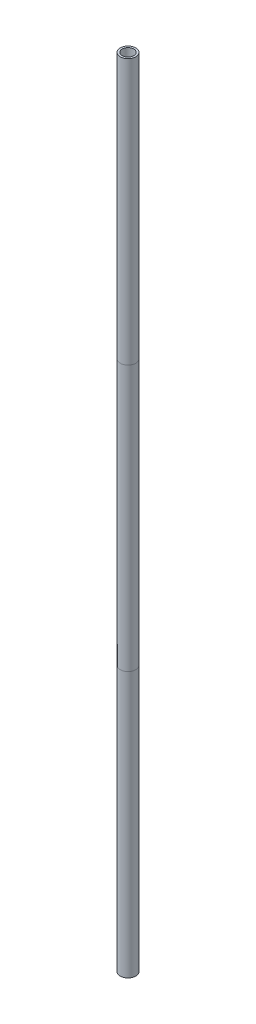
ISO-10303-21;
HEADER;
FILE_DESCRIPTION(('STEP AP214'),'2;1');
FILE_NAME('part.step','',(''),(''),'','','');
FILE_SCHEMA(('AUTOMOTIVE_DESIGN { 1 0 10303 214 1 1 1 1 }'));
ENDSEC;
DATA;
#1=APPLICATION_CONTEXT('core data for automotive mechanical design processes');
#2=APPLICATION_PROTOCOL_DEFINITION('international standard','automotive_design',2000,#1);
#3=PRODUCT_CONTEXT('',#1,'mechanical');
#4=PRODUCT('Part','Part','',(#3));
#5=PRODUCT_RELATED_PRODUCT_CATEGORY('part','',(#4));
#6=PRODUCT_DEFINITION_FORMATION('','',#4);
#7=PRODUCT_DEFINITION_CONTEXT('part definition',#1,'design');
#8=PRODUCT_DEFINITION('design','',#6,#7);
#9=PRODUCT_DEFINITION_SHAPE('','',#8);
#10=(LENGTH_UNIT() NAMED_UNIT(*) SI_UNIT(.MILLI.,.METRE.));
#11=(NAMED_UNIT(*) PLANE_ANGLE_UNIT() SI_UNIT($,.RADIAN.));
#12=(NAMED_UNIT(*) SI_UNIT($,.STERADIAN.) SOLID_ANGLE_UNIT());
#13=UNCERTAINTY_MEASURE_WITH_UNIT(LENGTH_MEASURE(1.E-05),#10,'distance_accuracy_value','');
#14=(GEOMETRIC_REPRESENTATION_CONTEXT(3) GLOBAL_UNCERTAINTY_ASSIGNED_CONTEXT((#13)) GLOBAL_UNIT_ASSIGNED_CONTEXT((#10,
#11,#12)) REPRESENTATION_CONTEXT('',''));
#15=CARTESIAN_POINT('',(0.,0.,0.));
#16=DIRECTION('',(0.,0.,1.));
#17=DIRECTION('',(1.,0.,0.));
#18=AXIS2_PLACEMENT_3D('',#15,#16,#17);
#19=CARTESIAN_POINT('',(-19.5,1333.33333333333,-19.51));
#20=DIRECTION('',(0.,-1.,0.));
#21=DIRECTION('',(0.,0.,-1.));
#22=AXIS2_PLACEMENT_3D('',#19,#20,#21);
#23=PLANE('',#22);
#24=CARTESIAN_POINT('',(0.,1333.33333333333,0.));
#25=DIRECTION('',(0.,-1.,0.));
#26=DIRECTION('',(0.,0.,-1.));
#27=AXIS2_PLACEMENT_3D('',#24,#25,#26);
#28=CIRCLE('',#27,19.5);
#29=CARTESIAN_POINT('',(0.,1333.33333333333,-19.5));
#30=VERTEX_POINT('',#29);
#31=EDGE_CURVE('E68',#30,#30,#28,.T.);
#32=ORIENTED_EDGE('',*,*,#31,.T.);
#33=EDGE_LOOP('',(#32));
#34=FACE_BOUND('',#33,.T.);
#35=CARTESIAN_POINT('',(0.,1333.33333333333,0.));
#36=DIRECTION('',(0.,-1.,0.));
#37=DIRECTION('',(0.,0.,-1.));
#38=AXIS2_PLACEMENT_3D('',#35,#36,#37);
#39=CIRCLE('',#38,14.5);
#40=CARTESIAN_POINT('',(0.,1333.33333333333,-14.5));
#41=VERTEX_POINT('',#40);
#42=EDGE_CURVE('E58',#41,#41,#39,.T.);
#43=ORIENTED_EDGE('',*,*,#42,.F.);
#44=EDGE_LOOP('',(#43));
#45=FACE_BOUND('',#44,.T.);
#46=ADVANCED_FACE('F54',(#34,#45),#23,.T.);
#47=CARTESIAN_POINT('',(0.,2000.,0.));
#48=DIRECTION('',(0.,1.,0.));
#49=DIRECTION('',(0.,0.,1.));
#50=AXIS2_PLACEMENT_3D('',#47,#48,#49);
#51=PLANE('',#50);
#52=CARTESIAN_POINT('',(0.,2000.,0.));
#53=DIRECTION('',(0.,1.,0.));
#54=DIRECTION('',(0.,0.,1.));
#55=AXIS2_PLACEMENT_3D('',#52,#53,#54);
#56=CIRCLE('',#55,19.5);
#57=CARTESIAN_POINT('',(0.,2000.,19.5));
#58=VERTEX_POINT('',#57);
#59=EDGE_CURVE('E62',#58,#58,#56,.T.);
#60=ORIENTED_EDGE('',*,*,#59,.T.);
#61=EDGE_LOOP('',(#60));
#62=FACE_BOUND('',#61,.T.);
#63=CARTESIAN_POINT('',(0.,2000.,0.));
#64=DIRECTION('',(0.,1.,0.));
#65=DIRECTION('',(0.,0.,1.));
#66=AXIS2_PLACEMENT_3D('',#63,#64,#65);
#67=CIRCLE('',#66,14.5);
#68=CARTESIAN_POINT('',(0.,2000.,14.5));
#69=VERTEX_POINT('',#68);
#70=EDGE_CURVE('E11',#69,#69,#67,.T.);
#71=ORIENTED_EDGE('',*,*,#70,.F.);
#72=EDGE_LOOP('',(#71));
#73=FACE_BOUND('',#72,.T.);
#74=ADVANCED_FACE('F78',(#62,#73),#51,.T.);
#75=CARTESIAN_POINT('',(0.,2000.,0.));
#76=DIRECTION('',(0.,-1.,0.));
#77=DIRECTION('',(0.,0.,-1.));
#78=AXIS2_PLACEMENT_3D('',#75,#76,#77);
#79=CYLINDRICAL_SURFACE('',#78,14.5);
#80=ORIENTED_EDGE('',*,*,#70,.T.);
#81=EDGE_LOOP('',(#80));
#82=FACE_BOUND('',#81,.T.);
#83=ORIENTED_EDGE('',*,*,#42,.T.);
#84=EDGE_LOOP('',(#83));
#85=FACE_BOUND('',#84,.T.);
#86=ADVANCED_FACE('F75',(#82,#85),#79,.F.);
#87=CARTESIAN_POINT('',(0.,2000.,0.));
#88=DIRECTION('',(0.,-1.,0.));
#89=DIRECTION('',(0.,0.,-1.));
#90=AXIS2_PLACEMENT_3D('',#87,#88,#89);
#91=CYLINDRICAL_SURFACE('',#90,19.5);
#92=ORIENTED_EDGE('',*,*,#59,.F.);
#93=EDGE_LOOP('',(#92));
#94=FACE_BOUND('',#93,.T.);
#95=ORIENTED_EDGE('',*,*,#31,.F.);
#96=EDGE_LOOP('',(#95));
#97=FACE_BOUND('',#96,.T.);
#98=ADVANCED_FACE('F56',(#94,#97),#91,.T.);
#99=CLOSED_SHELL('',(#46,#74,#86,#98));
#100=MANIFOLD_SOLID_BREP('B2',#99);
#101=CARTESIAN_POINT('',(-19.5,1333.33333333333,-19.51));
#102=DIRECTION('',(0.,-1.,0.));
#103=DIRECTION('',(0.,0.,-1.));
#104=AXIS2_PLACEMENT_3D('',#101,#102,#103);
#105=PLANE('',#104);
#106=CARTESIAN_POINT('',(0.,1333.33333333333,0.));
#107=DIRECTION('',(0.,-1.,0.));
#108=DIRECTION('',(0.,0.,-1.));
#109=AXIS2_PLACEMENT_3D('',#106,#107,#108);
#110=CIRCLE('',#109,14.5);
#111=CARTESIAN_POINT('',(0.,1333.33333333333,-14.5));
#112=VERTEX_POINT('',#111);
#113=EDGE_CURVE('E126',#112,#112,#110,.T.);
#114=ORIENTED_EDGE('',*,*,#113,.T.);
#115=EDGE_LOOP('',(#114));
#116=FACE_BOUND('',#115,.T.);
#117=CARTESIAN_POINT('',(0.,1333.33333333333,0.));
#118=DIRECTION('',(0.,-1.,0.));
#119=DIRECTION('',(0.,0.,-1.));
#120=AXIS2_PLACEMENT_3D('',#117,#118,#119);
#121=CIRCLE('',#120,19.5);
#122=CARTESIAN_POINT('',(0.,1333.33333333333,-19.5));
#123=VERTEX_POINT('',#122);
#124=EDGE_CURVE('E130',#123,#123,#121,.T.);
#125=ORIENTED_EDGE('',*,*,#124,.F.);
#126=EDGE_LOOP('',(#125));
#127=FACE_BOUND('',#126,.T.);
#128=ADVANCED_FACE('F122',(#116,#127),#105,.F.);
#129=CARTESIAN_POINT('',(-19.5,666.666666666667,-19.51));
#130=DIRECTION('',(0.,-1.,0.));
#131=DIRECTION('',(0.,0.,-1.));
#132=AXIS2_PLACEMENT_3D('',#129,#130,#131);
#133=PLANE('',#132);
#134=CARTESIAN_POINT('',(0.,666.666666666667,0.));
#135=DIRECTION('',(0.,-1.,0.));
#136=DIRECTION('',(0.,0.,-1.));
#137=AXIS2_PLACEMENT_3D('',#134,#135,#136);
#138=CIRCLE('',#137,19.5);
#139=CARTESIAN_POINT('',(0.,666.666666666667,-19.5));
#140=VERTEX_POINT('',#139);
#141=EDGE_CURVE('E135',#140,#140,#138,.T.);
#142=ORIENTED_EDGE('',*,*,#141,.T.);
#143=EDGE_LOOP('',(#142));
#144=FACE_BOUND('',#143,.T.);
#145=CARTESIAN_POINT('',(0.,666.666666666667,0.));
#146=DIRECTION('',(0.,-1.,0.));
#147=DIRECTION('',(0.,0.,-1.));
#148=AXIS2_PLACEMENT_3D('',#145,#146,#147);
#149=CIRCLE('',#148,14.5);
#150=CARTESIAN_POINT('',(0.,666.666666666667,-14.5));
#151=VERTEX_POINT('',#150);
#152=EDGE_CURVE('E53',#151,#151,#149,.T.);
#153=ORIENTED_EDGE('',*,*,#152,.F.);
#154=EDGE_LOOP('',(#153));
#155=FACE_BOUND('',#154,.T.);
#156=ADVANCED_FACE('F147',(#144,#155),#133,.T.);
#157=CARTESIAN_POINT('',(0.,2000.,0.));
#158=DIRECTION('',(0.,-1.,0.));
#159=DIRECTION('',(0.,0.,-1.));
#160=AXIS2_PLACEMENT_3D('',#157,#158,#159);
#161=CYLINDRICAL_SURFACE('',#160,14.5);
#162=ORIENTED_EDGE('',*,*,#113,.F.);
#163=EDGE_LOOP('',(#162));
#164=FACE_BOUND('',#163,.T.);
#165=ORIENTED_EDGE('',*,*,#152,.T.);
#166=EDGE_LOOP('',(#165));
#167=FACE_BOUND('',#166,.T.);
#168=ADVANCED_FACE('F145',(#164,#167),#161,.F.);
#169=CARTESIAN_POINT('',(0.,2000.,0.));
#170=DIRECTION('',(0.,-1.,0.));
#171=DIRECTION('',(0.,0.,-1.));
#172=AXIS2_PLACEMENT_3D('',#169,#170,#171);
#173=CYLINDRICAL_SURFACE('',#172,19.5);
#174=ORIENTED_EDGE('',*,*,#124,.T.);
#175=EDGE_LOOP('',(#174));
#176=FACE_BOUND('',#175,.T.);
#177=ORIENTED_EDGE('',*,*,#141,.F.);
#178=EDGE_LOOP('',(#177));
#179=FACE_BOUND('',#178,.T.);
#180=ADVANCED_FACE('F124',(#176,#179),#173,.T.);
#181=CLOSED_SHELL('',(#128,#156,#168,#180));
#182=MANIFOLD_SOLID_BREP('B6',#181);
#183=CARTESIAN_POINT('',(-19.5,666.666666666667,-19.51));
#184=DIRECTION('',(0.,-1.,0.));
#185=DIRECTION('',(0.,0.,-1.));
#186=AXIS2_PLACEMENT_3D('',#183,#184,#185);
#187=PLANE('',#186);
#188=CARTESIAN_POINT('',(0.,666.666666666667,0.));
#189=DIRECTION('',(0.,-1.,0.));
#190=DIRECTION('',(0.,0.,-1.));
#191=AXIS2_PLACEMENT_3D('',#188,#189,#190);
#192=CIRCLE('',#191,14.5);
#193=CARTESIAN_POINT('',(0.,666.666666666667,-14.5));
#194=VERTEX_POINT('',#193);
#195=EDGE_CURVE('E121',#194,#194,#192,.T.);
#196=ORIENTED_EDGE('',*,*,#195,.T.);
#197=EDGE_LOOP('',(#196));
#198=FACE_BOUND('',#197,.T.);
#199=CARTESIAN_POINT('',(0.,666.666666666667,0.));
#200=DIRECTION('',(0.,-1.,0.));
#201=DIRECTION('',(0.,0.,-1.));
#202=AXIS2_PLACEMENT_3D('',#199,#200,#201);
#203=CIRCLE('',#202,19.5);
#204=CARTESIAN_POINT('',(0.,666.666666666667,-19.5));
#205=VERTEX_POINT('',#204);
#206=EDGE_CURVE('E185',#205,#205,#203,.T.);
#207=ORIENTED_EDGE('',*,*,#206,.F.);
#208=EDGE_LOOP('',(#207));
#209=FACE_BOUND('',#208,.T.);
#210=ADVANCED_FACE('F182',(#198,#209),#187,.F.);
#211=CARTESIAN_POINT('',(0.,0.,0.));
#212=DIRECTION('',(0.,1.,0.));
#213=DIRECTION('',(0.,0.,1.));
#214=AXIS2_PLACEMENT_3D('',#211,#212,#213);
#215=PLANE('',#214);
#216=CARTESIAN_POINT('',(0.,0.,0.));
#217=DIRECTION('',(0.,1.,0.));
#218=DIRECTION('',(0.,0.,1.));
#219=AXIS2_PLACEMENT_3D('',#216,#217,#218);
#220=CIRCLE('',#219,19.5);
#221=CARTESIAN_POINT('',(0.,0.,19.5));
#222=VERTEX_POINT('',#221);
#223=EDGE_CURVE('E192',#222,#222,#220,.T.);
#224=ORIENTED_EDGE('',*,*,#223,.F.);
#225=EDGE_LOOP('',(#224));
#226=FACE_BOUND('',#225,.T.);
#227=CARTESIAN_POINT('',(0.,0.,0.));
#228=DIRECTION('',(0.,1.,0.));
#229=DIRECTION('',(0.,0.,1.));
#230=AXIS2_PLACEMENT_3D('',#227,#228,#229);
#231=CIRCLE('',#230,14.5);
#232=CARTESIAN_POINT('',(0.,0.,14.5));
#233=VERTEX_POINT('',#232);
#234=EDGE_CURVE('E196',#233,#233,#231,.T.);
#235=ORIENTED_EDGE('',*,*,#234,.T.);
#236=EDGE_LOOP('',(#235));
#237=FACE_BOUND('',#236,.T.);
#238=ADVANCED_FACE('F200',(#226,#237),#215,.F.);
#239=CARTESIAN_POINT('',(0.,2000.,0.));
#240=DIRECTION('',(0.,-1.,0.));
#241=DIRECTION('',(0.,0.,-1.));
#242=AXIS2_PLACEMENT_3D('',#239,#240,#241);
#243=CYLINDRICAL_SURFACE('',#242,14.5);
#244=ORIENTED_EDGE('',*,*,#195,.F.);
#245=EDGE_LOOP('',(#244));
#246=FACE_BOUND('',#245,.T.);
#247=ORIENTED_EDGE('',*,*,#234,.F.);
#248=EDGE_LOOP('',(#247));
#249=FACE_BOUND('',#248,.T.);
#250=ADVANCED_FACE('F202',(#246,#249),#243,.F.);
#251=CARTESIAN_POINT('',(0.,2000.,0.));
#252=DIRECTION('',(0.,-1.,0.));
#253=DIRECTION('',(0.,0.,-1.));
#254=AXIS2_PLACEMENT_3D('',#251,#252,#253);
#255=CYLINDRICAL_SURFACE('',#254,19.5);
#256=ORIENTED_EDGE('',*,*,#206,.T.);
#257=EDGE_LOOP('',(#256));
#258=FACE_BOUND('',#257,.T.);
#259=ORIENTED_EDGE('',*,*,#223,.T.);
#260=EDGE_LOOP('',(#259));
#261=FACE_BOUND('',#260,.T.);
#262=ADVANCED_FACE('F204',(#258,#261),#255,.T.);
#263=CLOSED_SHELL('',(#210,#238,#250,#262));
#264=MANIFOLD_SOLID_BREP('B48',#263);
#265=ADVANCED_BREP_SHAPE_REPRESENTATION('',(#18,#100,#182,#264),#14);
#266=SHAPE_DEFINITION_REPRESENTATION(#9,#265);
ENDSEC;
END-ISO-10303-21;
